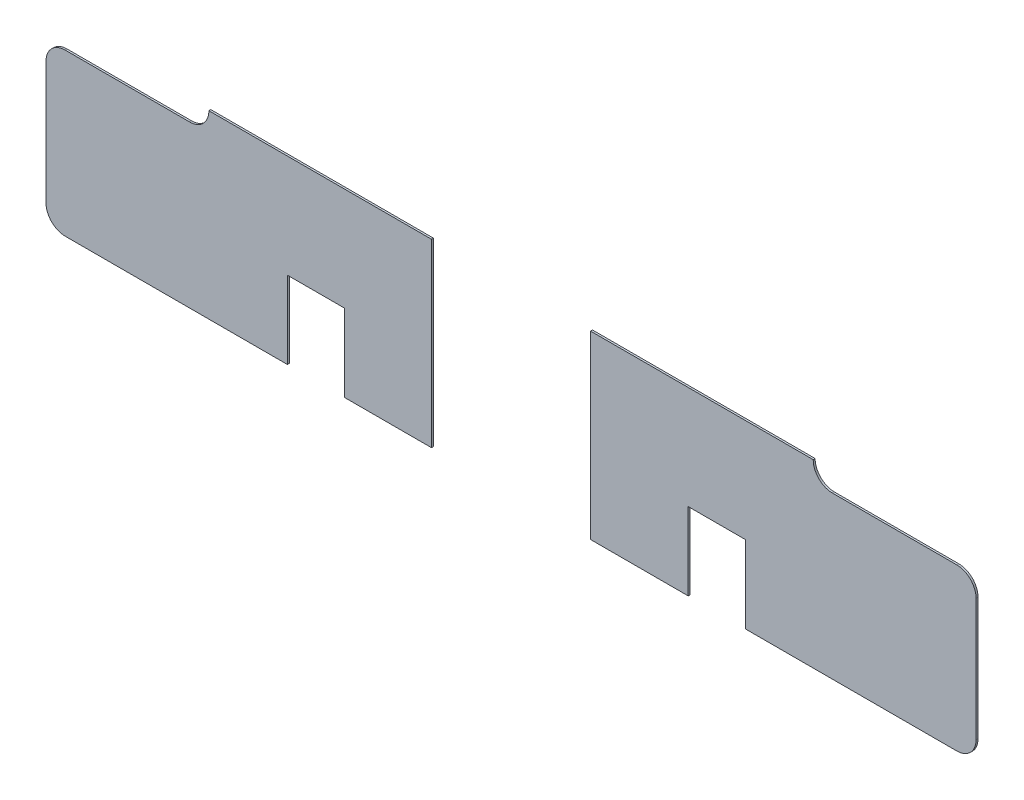
ISO-10303-21;
HEADER;
FILE_DESCRIPTION(('STEP AP214'),'2;1');
FILE_NAME('part.step','',(''),(''),'','','');
FILE_SCHEMA(('AUTOMOTIVE_DESIGN { 1 0 10303 214 1 1 1 1 }'));
ENDSEC;
DATA;
#1=APPLICATION_CONTEXT('core data for automotive mechanical design processes');
#2=APPLICATION_PROTOCOL_DEFINITION('international standard','automotive_design',2000,#1);
#3=PRODUCT_CONTEXT('',#1,'mechanical');
#4=PRODUCT('Part','Part','',(#3));
#5=PRODUCT_RELATED_PRODUCT_CATEGORY('part','',(#4));
#6=PRODUCT_DEFINITION_FORMATION('','',#4);
#7=PRODUCT_DEFINITION_CONTEXT('part definition',#1,'design');
#8=PRODUCT_DEFINITION('design','',#6,#7);
#9=PRODUCT_DEFINITION_SHAPE('','',#8);
#10=(LENGTH_UNIT() NAMED_UNIT(*) SI_UNIT(.MILLI.,.METRE.));
#11=(NAMED_UNIT(*) PLANE_ANGLE_UNIT() SI_UNIT($,.RADIAN.));
#12=(NAMED_UNIT(*) SI_UNIT($,.STERADIAN.) SOLID_ANGLE_UNIT());
#13=UNCERTAINTY_MEASURE_WITH_UNIT(LENGTH_MEASURE(1.E-05),#10,'distance_accuracy_value','');
#14=(GEOMETRIC_REPRESENTATION_CONTEXT(3) GLOBAL_UNCERTAINTY_ASSIGNED_CONTEXT((#13)) GLOBAL_UNIT_ASSIGNED_CONTEXT((#10,
#11,#12)) REPRESENTATION_CONTEXT('',''));
#15=CARTESIAN_POINT('',(0.,0.,0.));
#16=DIRECTION('',(0.,0.,1.));
#17=DIRECTION('',(1.,0.,0.));
#18=AXIS2_PLACEMENT_3D('',#15,#16,#17);
#19=CARTESIAN_POINT('',(0.,-2.80000000000001,0.1));
#20=DIRECTION('',(0.,-1.,0.));
#21=DIRECTION('',(1.,0.,0.));
#22=AXIS2_PLACEMENT_3D('',#19,#20,#21);
#23=PLANE('',#22);
#24=DIRECTION('',(-1.,0.,0.));
#25=VECTOR('',#24,1.);
#26=CARTESIAN_POINT('',(0.,-2.80000000000001,0.));
#27=LINE('',#26,#25);
#28=CARTESIAN_POINT('',(57.3430582988946,-2.80000000000003,0.));
#29=VERTEX_POINT('',#28);
#30=CARTESIAN_POINT('',(46.4068453882986,-2.80000000000003,0.));
#31=VERTEX_POINT('',#30);
#32=EDGE_CURVE('E160',#29,#31,#27,.T.);
#33=ORIENTED_EDGE('',*,*,#32,.F.);
#34=DIRECTION('',(0.,0.,-1.));
#35=VECTOR('',#34,1.);
#36=CARTESIAN_POINT('',(57.3430582988946,-2.80000000000003,0.1));
#37=LINE('',#36,#35);
#38=CARTESIAN_POINT('',(57.3430582988946,-2.80000000000003,0.1));
#39=VERTEX_POINT('',#38);
#40=EDGE_CURVE('E12',#39,#29,#37,.T.);
#41=ORIENTED_EDGE('',*,*,#40,.F.);
#42=DIRECTION('',(-1.,0.,0.));
#43=VECTOR('',#42,1.);
#44=CARTESIAN_POINT('',(0.,-2.80000000000001,0.1));
#45=LINE('',#44,#43);
#46=CARTESIAN_POINT('',(46.4068453882986,-2.80000000000003,0.1));
#47=VERTEX_POINT('',#46);
#48=EDGE_CURVE('E190',#39,#47,#45,.T.);
#49=ORIENTED_EDGE('',*,*,#48,.T.);
#50=DIRECTION('',(0.,0.,-1.));
#51=VECTOR('',#50,1.);
#52=CARTESIAN_POINT('',(46.4068453882986,-2.80000000000003,0.1));
#53=LINE('',#52,#51);
#54=EDGE_CURVE('E58',#47,#31,#53,.T.);
#55=ORIENTED_EDGE('',*,*,#54,.T.);
#56=EDGE_LOOP('',(#33,#41,#49,#55));
#57=FACE_BOUND('',#56,.T.);
#58=ADVANCED_FACE('F42',(#57),#23,.T.);
#59=CARTESIAN_POINT('',(57.3363916322279,-1.8066666666667,0.1));
#60=DIRECTION('',(0.,0.,-1.));
#61=DIRECTION('',(-1.,0.,0.));
#62=AXIS2_PLACEMENT_3D('',#59,#60,#61);
#63=CYLINDRICAL_SURFACE('',#62,0.993355704446072);
#64=CARTESIAN_POINT('',(57.3363916322279,-1.8066666666667,0.));
#65=DIRECTION('',(0.,0.,1.));
#66=DIRECTION('',(1.,0.,0.));
#67=AXIS2_PLACEMENT_3D('',#64,#65,#66);
#68=CIRCLE('',#67,0.993355704446072);
#69=CARTESIAN_POINT('',(58.3297249655613,-1.80000000000002,0.));
#70=VERTEX_POINT('',#69);
#71=EDGE_CURVE('E162',#29,#70,#68,.T.);
#72=ORIENTED_EDGE('',*,*,#71,.T.);
#73=DIRECTION('',(0.,0.,-1.));
#74=VECTOR('',#73,1.);
#75=CARTESIAN_POINT('',(58.3297249655613,-1.80000000000002,0.1));
#76=LINE('',#75,#74);
#77=CARTESIAN_POINT('',(58.3297249655613,-1.80000000000002,0.1));
#78=VERTEX_POINT('',#77);
#79=EDGE_CURVE('E50',#78,#70,#76,.T.);
#80=ORIENTED_EDGE('',*,*,#79,.F.);
#81=CARTESIAN_POINT('',(57.3363916322279,-1.8066666666667,0.1));
#82=DIRECTION('',(0.,0.,1.));
#83=DIRECTION('',(1.,0.,0.));
#84=AXIS2_PLACEMENT_3D('',#81,#82,#83);
#85=CIRCLE('',#84,0.993355704446072);
#86=EDGE_CURVE('E231',#39,#78,#85,.T.);
#87=ORIENTED_EDGE('',*,*,#86,.F.);
#88=ORIENTED_EDGE('',*,*,#40,.T.);
#89=EDGE_LOOP('',(#72,#80,#87,#88));
#90=FACE_BOUND('',#89,.T.);
#91=ADVANCED_FACE('F256',(#90),#63,.T.);
#92=CARTESIAN_POINT('',(58.3297249655613,-1.27820550443745E-13,0.1));
#93=DIRECTION('',(-1.,0.,0.));
#94=DIRECTION('',(0.,-1.,0.));
#95=AXIS2_PLACEMENT_3D('',#92,#93,#94);
#96=PLANE('',#95);
#97=DIRECTION('',(0.,1.,0.));
#98=VECTOR('',#97,1.);
#99=CARTESIAN_POINT('',(58.3297249655613,-1.27820550443745E-13,0.));
#100=LINE('',#99,#98);
#101=CARTESIAN_POINT('',(58.3297249655613,4.53299999999996,0.));
#102=VERTEX_POINT('',#101);
#103=EDGE_CURVE('E164',#70,#102,#100,.T.);
#104=ORIENTED_EDGE('',*,*,#103,.T.);
#105=DIRECTION('',(0.,0.,-1.));
#106=VECTOR('',#105,1.);
#107=CARTESIAN_POINT('',(58.3297249655613,4.53299999999996,0.1));
#108=LINE('',#107,#106);
#109=CARTESIAN_POINT('',(58.3297249655613,4.53299999999996,0.1));
#110=VERTEX_POINT('',#109);
#111=EDGE_CURVE('E204',#110,#102,#108,.T.);
#112=ORIENTED_EDGE('',*,*,#111,.F.);
#113=DIRECTION('',(0.,1.,0.));
#114=VECTOR('',#113,1.);
#115=CARTESIAN_POINT('',(58.3297249655613,-1.27820550443745E-13,0.1));
#116=LINE('',#115,#114);
#117=EDGE_CURVE('E213',#78,#110,#116,.T.);
#118=ORIENTED_EDGE('',*,*,#117,.F.);
#119=ORIENTED_EDGE('',*,*,#79,.T.);
#120=EDGE_LOOP('',(#104,#112,#118,#119));
#121=FACE_BOUND('',#120,.T.);
#122=ADVANCED_FACE('F211',(#121),#96,.F.);
#123=CARTESIAN_POINT('',(57.3363916322279,4.53966666666664,0.1));
#124=DIRECTION('',(0.,0.,-1.));
#125=DIRECTION('',(-1.,0.,0.));
#126=AXIS2_PLACEMENT_3D('',#123,#124,#125);
#127=CYLINDRICAL_SURFACE('',#126,0.993355704446079);
#128=CARTESIAN_POINT('',(57.3363916322279,4.53966666666664,0.));
#129=DIRECTION('',(0.,0.,1.));
#130=DIRECTION('',(1.,0.,0.));
#131=AXIS2_PLACEMENT_3D('',#128,#129,#130);
#132=CIRCLE('',#131,0.993355704446079);
#133=CARTESIAN_POINT('',(57.3430582988946,5.53299999999998,0.));
#134=VERTEX_POINT('',#133);
#135=EDGE_CURVE('E166',#102,#134,#132,.T.);
#136=ORIENTED_EDGE('',*,*,#135,.T.);
#137=DIRECTION('',(0.,0.,-1.));
#138=VECTOR('',#137,1.);
#139=CARTESIAN_POINT('',(57.3430582988946,5.53299999999998,0.1));
#140=LINE('',#139,#138);
#141=CARTESIAN_POINT('',(57.3430582988946,5.53299999999998,0.1));
#142=VERTEX_POINT('',#141);
#143=EDGE_CURVE('E202',#142,#134,#140,.T.);
#144=ORIENTED_EDGE('',*,*,#143,.F.);
#145=CARTESIAN_POINT('',(57.3363916322279,4.53966666666664,0.1));
#146=DIRECTION('',(0.,0.,1.));
#147=DIRECTION('',(1.,0.,0.));
#148=AXIS2_PLACEMENT_3D('',#145,#146,#147);
#149=CIRCLE('',#148,0.993355704446079);
#150=EDGE_CURVE('E225',#110,#142,#149,.T.);
#151=ORIENTED_EDGE('',*,*,#150,.F.);
#152=ORIENTED_EDGE('',*,*,#111,.T.);
#153=EDGE_LOOP('',(#136,#144,#151,#152));
#154=FACE_BOUND('',#153,.T.);
#155=ADVANCED_FACE('F222',(#154),#127,.T.);
#156=CARTESIAN_POINT('',(0.,5.53299999999996,0.1));
#157=DIRECTION('',(0.,1.,0.));
#158=DIRECTION('',(-1.,0.,0.));
#159=AXIS2_PLACEMENT_3D('',#156,#157,#158);
#160=PLANE('',#159);
#161=DIRECTION('',(1.,0.,0.));
#162=VECTOR('',#161,1.);
#163=CARTESIAN_POINT('',(0.,5.53299999999996,0.));
#164=LINE('',#163,#162);
#165=CARTESIAN_POINT('',(50.8971649655613,5.53299999999997,0.));
#166=VERTEX_POINT('',#165);
#167=EDGE_CURVE('E169',#166,#134,#164,.T.);
#168=ORIENTED_EDGE('',*,*,#167,.F.);
#169=DIRECTION('',(0.,0.,-1.));
#170=VECTOR('',#169,1.);
#171=CARTESIAN_POINT('',(50.8971649655613,5.53299999999997,0.1));
#172=LINE('',#171,#170);
#173=CARTESIAN_POINT('',(50.8971649655613,5.53299999999997,0.1));
#174=VERTEX_POINT('',#173);
#175=EDGE_CURVE('E200',#174,#166,#172,.T.);
#176=ORIENTED_EDGE('',*,*,#175,.F.);
#177=DIRECTION('',(1.,0.,0.));
#178=VECTOR('',#177,1.);
#179=CARTESIAN_POINT('',(0.,5.53299999999996,0.1));
#180=LINE('',#179,#178);
#181=EDGE_CURVE('E227',#174,#142,#180,.T.);
#182=ORIENTED_EDGE('',*,*,#181,.T.);
#183=ORIENTED_EDGE('',*,*,#143,.T.);
#184=EDGE_LOOP('',(#168,#176,#182,#183));
#185=FACE_BOUND('',#184,.T.);
#186=ADVANCED_FACE('F267',(#185),#160,.T.);
#187=CARTESIAN_POINT('',(50.9038316322279,6.52633333333336,0.1));
#188=DIRECTION('',(0.,0.,-1.));
#189=DIRECTION('',(-1.,0.,0.));
#190=AXIS2_PLACEMENT_3D('',#187,#188,#189);
#191=CYLINDRICAL_SURFACE('',#190,0.993355704446132);
#192=CARTESIAN_POINT('',(50.9038316322279,6.52633333333336,0.));
#193=DIRECTION('',(0.,0.,1.));
#194=DIRECTION('',(1.,0.,0.));
#195=AXIS2_PLACEMENT_3D('',#192,#193,#194);
#196=CIRCLE('',#195,0.993355704446132);
#197=CARTESIAN_POINT('',(49.9104982988945,6.53300000000002,0.));
#198=VERTEX_POINT('',#197);
#199=EDGE_CURVE('E172',#198,#166,#196,.T.);
#200=ORIENTED_EDGE('',*,*,#199,.F.);
#201=DIRECTION('',(0.,0.,-1.));
#202=VECTOR('',#201,1.);
#203=CARTESIAN_POINT('',(49.9104982988945,6.53300000000002,0.1));
#204=LINE('',#203,#202);
#205=CARTESIAN_POINT('',(49.9104982988945,6.53300000000002,0.1));
#206=VERTEX_POINT('',#205);
#207=EDGE_CURVE('E198',#206,#198,#204,.T.);
#208=ORIENTED_EDGE('',*,*,#207,.F.);
#209=CARTESIAN_POINT('',(50.9038316322279,6.52633333333336,0.1));
#210=DIRECTION('',(0.,0.,1.));
#211=DIRECTION('',(1.,0.,0.));
#212=AXIS2_PLACEMENT_3D('',#209,#210,#211);
#213=CIRCLE('',#212,0.993355704446132);
#214=EDGE_CURVE('E229',#206,#174,#213,.T.);
#215=ORIENTED_EDGE('',*,*,#214,.T.);
#216=ORIENTED_EDGE('',*,*,#175,.T.);
#217=EDGE_LOOP('',(#200,#208,#215,#216));
#218=FACE_BOUND('',#217,.T.);
#219=ADVANCED_FACE('F270',(#218),#191,.F.);
#220=CARTESIAN_POINT('',(0.,6.53300000000002,0.1));
#221=DIRECTION('',(0.,-1.,0.));
#222=DIRECTION('',(0.,0.,-1.));
#223=AXIS2_PLACEMENT_3D('',#220,#221,#222);
#224=PLANE('',#223);
#225=DIRECTION('',(-1.,0.,0.));
#226=VECTOR('',#225,1.);
#227=CARTESIAN_POINT('',(0.,6.53300000000002,0.));
#228=LINE('',#227,#226);
#229=CARTESIAN_POINT('',(38.4000449655613,6.53300000000002,0.));
#230=VERTEX_POINT('',#229);
#231=EDGE_CURVE('E175',#198,#230,#228,.T.);
#232=ORIENTED_EDGE('',*,*,#231,.T.);
#233=DIRECTION('',(0.,0.,-1.));
#234=VECTOR('',#233,1.);
#235=CARTESIAN_POINT('',(38.4000449655613,6.53300000000002,0.1));
#236=LINE('',#235,#234);
#237=CARTESIAN_POINT('',(38.4000449655613,6.53300000000002,0.1));
#238=VERTEX_POINT('',#237);
#239=EDGE_CURVE('E196',#238,#230,#236,.T.);
#240=ORIENTED_EDGE('',*,*,#239,.F.);
#241=DIRECTION('',(-1.,0.,0.));
#242=VECTOR('',#241,1.);
#243=CARTESIAN_POINT('',(0.,6.53300000000002,0.1));
#244=LINE('',#243,#242);
#245=EDGE_CURVE('E237',#206,#238,#244,.T.);
#246=ORIENTED_EDGE('',*,*,#245,.F.);
#247=ORIENTED_EDGE('',*,*,#207,.T.);
#248=EDGE_LOOP('',(#232,#240,#246,#247));
#249=FACE_BOUND('',#248,.T.);
#250=ADVANCED_FACE('F274',(#249),#224,.F.);
#251=CARTESIAN_POINT('',(38.4000449655613,0.,0.1));
#252=DIRECTION('',(-1.,0.,0.));
#253=DIRECTION('',(0.,-1.,0.));
#254=AXIS2_PLACEMENT_3D('',#251,#252,#253);
#255=PLANE('',#254);
#256=DIRECTION('',(0.,1.,0.));
#257=VECTOR('',#256,1.);
#258=CARTESIAN_POINT('',(38.4000449655613,0.,0.));
#259=LINE('',#258,#257);
#260=CARTESIAN_POINT('',(38.4000449655613,-2.80000000000003,0.));
#261=VERTEX_POINT('',#260);
#262=EDGE_CURVE('E178',#261,#230,#259,.T.);
#263=ORIENTED_EDGE('',*,*,#262,.F.);
#264=DIRECTION('',(0.,0.,-1.));
#265=VECTOR('',#264,1.);
#266=CARTESIAN_POINT('',(38.4000449655613,-2.80000000000003,0.1));
#267=LINE('',#266,#265);
#268=CARTESIAN_POINT('',(38.4000449655613,-2.80000000000003,0.1));
#269=VERTEX_POINT('',#268);
#270=EDGE_CURVE('E194',#269,#261,#267,.T.);
#271=ORIENTED_EDGE('',*,*,#270,.F.);
#272=DIRECTION('',(0.,1.,0.));
#273=VECTOR('',#272,1.);
#274=CARTESIAN_POINT('',(38.4000449655613,0.,0.1));
#275=LINE('',#274,#273);
#276=EDGE_CURVE('E239',#269,#238,#275,.T.);
#277=ORIENTED_EDGE('',*,*,#276,.T.);
#278=ORIENTED_EDGE('',*,*,#239,.T.);
#279=EDGE_LOOP('',(#263,#271,#277,#278));
#280=FACE_BOUND('',#279,.T.);
#281=ADVANCED_FACE('F278',(#280),#255,.T.);
#282=CARTESIAN_POINT('',(0.,-2.80000000000003,0.1));
#283=DIRECTION('',(0.,-1.,0.));
#284=DIRECTION('',(0.,0.,-1.));
#285=AXIS2_PLACEMENT_3D('',#282,#283,#284);
#286=PLANE('',#285);
#287=DIRECTION('',(-1.,0.,0.));
#288=VECTOR('',#287,1.);
#289=CARTESIAN_POINT('',(0.,-2.80000000000003,0.));
#290=LINE('',#289,#288);
#291=CARTESIAN_POINT('',(43.4468453882985,-2.80000000000003,0.));
#292=VERTEX_POINT('',#291);
#293=EDGE_CURVE('E181',#292,#261,#290,.T.);
#294=ORIENTED_EDGE('',*,*,#293,.F.);
#295=DIRECTION('',(0.,0.,-1.));
#296=VECTOR('',#295,1.);
#297=CARTESIAN_POINT('',(43.4468453882985,-2.80000000000003,0.1));
#298=LINE('',#297,#296);
#299=CARTESIAN_POINT('',(43.4468453882985,-2.80000000000003,0.1));
#300=VERTEX_POINT('',#299);
#301=EDGE_CURVE('E141',#300,#292,#298,.T.);
#302=ORIENTED_EDGE('',*,*,#301,.F.);
#303=DIRECTION('',(-1.,0.,0.));
#304=VECTOR('',#303,1.);
#305=CARTESIAN_POINT('',(0.,-2.80000000000003,0.1));
#306=LINE('',#305,#304);
#307=EDGE_CURVE('E152',#300,#269,#306,.T.);
#308=ORIENTED_EDGE('',*,*,#307,.T.);
#309=ORIENTED_EDGE('',*,*,#270,.T.);
#310=EDGE_LOOP('',(#294,#302,#308,#309));
#311=FACE_BOUND('',#310,.T.);
#312=ADVANCED_FACE('F243',(#311),#286,.T.);
#313=CARTESIAN_POINT('',(43.4468453882985,0.,0.1));
#314=DIRECTION('',(1.,0.,0.));
#315=DIRECTION('',(0.,0.,-1.));
#316=AXIS2_PLACEMENT_3D('',#313,#314,#315);
#317=PLANE('',#316);
#318=DIRECTION('',(0.,-1.,0.));
#319=VECTOR('',#318,1.);
#320=CARTESIAN_POINT('',(43.4468453882985,0.,0.));
#321=LINE('',#320,#319);
#322=CARTESIAN_POINT('',(43.4468453882985,1.19999999999997,0.));
#323=VERTEX_POINT('',#322);
#324=EDGE_CURVE('E137',#323,#292,#321,.T.);
#325=ORIENTED_EDGE('',*,*,#324,.F.);
#326=DIRECTION('',(0.,0.,-1.));
#327=VECTOR('',#326,1.);
#328=CARTESIAN_POINT('',(43.4468453882985,1.19999999999997,0.1));
#329=LINE('',#328,#327);
#330=CARTESIAN_POINT('',(43.4468453882985,1.19999999999997,0.1));
#331=VERTEX_POINT('',#330);
#332=EDGE_CURVE('E132',#331,#323,#329,.T.);
#333=ORIENTED_EDGE('',*,*,#332,.F.);
#334=DIRECTION('',(0.,-1.,0.));
#335=VECTOR('',#334,1.);
#336=CARTESIAN_POINT('',(43.4468453882985,0.,0.1));
#337=LINE('',#336,#335);
#338=EDGE_CURVE('E135',#331,#300,#337,.T.);
#339=ORIENTED_EDGE('',*,*,#338,.T.);
#340=ORIENTED_EDGE('',*,*,#301,.T.);
#341=EDGE_LOOP('',(#325,#333,#339,#340));
#342=FACE_BOUND('',#341,.T.);
#343=ADVANCED_FACE('F134',(#342),#317,.T.);
#344=CARTESIAN_POINT('',(0.,1.19999999999997,0.1));
#345=DIRECTION('',(0.,-1.,0.));
#346=DIRECTION('',(0.,0.,-1.));
#347=AXIS2_PLACEMENT_3D('',#344,#345,#346);
#348=PLANE('',#347);
#349=DIRECTION('',(-1.,0.,0.));
#350=VECTOR('',#349,1.);
#351=CARTESIAN_POINT('',(0.,1.19999999999997,0.));
#352=LINE('',#351,#350);
#353=CARTESIAN_POINT('',(46.4068453882986,1.19999999999997,0.));
#354=VERTEX_POINT('',#353);
#355=EDGE_CURVE('E185',#354,#323,#352,.T.);
#356=ORIENTED_EDGE('',*,*,#355,.F.);
#357=DIRECTION('',(0.,0.,-1.));
#358=VECTOR('',#357,1.);
#359=CARTESIAN_POINT('',(46.4068453882986,1.19999999999997,0.1));
#360=LINE('',#359,#358);
#361=CARTESIAN_POINT('',(46.4068453882986,1.19999999999997,0.1));
#362=VERTEX_POINT('',#361);
#363=EDGE_CURVE('E95',#362,#354,#360,.T.);
#364=ORIENTED_EDGE('',*,*,#363,.F.);
#365=DIRECTION('',(-1.,0.,0.));
#366=VECTOR('',#365,1.);
#367=CARTESIAN_POINT('',(0.,1.19999999999997,0.1));
#368=LINE('',#367,#366);
#369=EDGE_CURVE('E149',#362,#331,#368,.T.);
#370=ORIENTED_EDGE('',*,*,#369,.T.);
#371=ORIENTED_EDGE('',*,*,#332,.T.);
#372=EDGE_LOOP('',(#356,#364,#370,#371));
#373=FACE_BOUND('',#372,.T.);
#374=ADVANCED_FACE('F154',(#373),#348,.T.);
#375=CARTESIAN_POINT('',(46.4068453882986,0.,0.1));
#376=DIRECTION('',(-1.,0.,0.));
#377=DIRECTION('',(0.,0.,1.));
#378=AXIS2_PLACEMENT_3D('',#375,#376,#377);
#379=PLANE('',#378);
#380=DIRECTION('',(0.,1.,0.));
#381=VECTOR('',#380,1.);
#382=CARTESIAN_POINT('',(46.4068453882986,0.,0.));
#383=LINE('',#382,#381);
#384=EDGE_CURVE('E187',#31,#354,#383,.T.);
#385=ORIENTED_EDGE('',*,*,#384,.F.);
#386=ORIENTED_EDGE('',*,*,#54,.F.);
#387=DIRECTION('',(0.,1.,0.));
#388=VECTOR('',#387,1.);
#389=CARTESIAN_POINT('',(46.4068453882986,0.,0.1));
#390=LINE('',#389,#388);
#391=EDGE_CURVE('E155',#47,#362,#390,.T.);
#392=ORIENTED_EDGE('',*,*,#391,.T.);
#393=ORIENTED_EDGE('',*,*,#363,.T.);
#394=EDGE_LOOP('',(#385,#386,#392,#393));
#395=FACE_BOUND('',#394,.T.);
#396=ADVANCED_FACE('F245',(#395),#379,.T.);
#397=CARTESIAN_POINT('',(0.,0.,0.1));
#398=DIRECTION('',(0.,0.,1.));
#399=DIRECTION('',(1.,0.,0.));
#400=AXIS2_PLACEMENT_3D('',#397,#398,#399);
#401=PLANE('',#400);
#402=ORIENTED_EDGE('',*,*,#48,.F.);
#403=ORIENTED_EDGE('',*,*,#86,.T.);
#404=ORIENTED_EDGE('',*,*,#117,.T.);
#405=ORIENTED_EDGE('',*,*,#150,.T.);
#406=ORIENTED_EDGE('',*,*,#181,.F.);
#407=ORIENTED_EDGE('',*,*,#214,.F.);
#408=ORIENTED_EDGE('',*,*,#245,.T.);
#409=ORIENTED_EDGE('',*,*,#276,.F.);
#410=ORIENTED_EDGE('',*,*,#307,.F.);
#411=ORIENTED_EDGE('',*,*,#338,.F.);
#412=ORIENTED_EDGE('',*,*,#369,.F.);
#413=ORIENTED_EDGE('',*,*,#391,.F.);
#414=EDGE_LOOP('',(#402,#403,#404,#405,#406,#407,#408,#409,#410,#411,#412,#413));
#415=FACE_BOUND('',#414,.T.);
#416=ADVANCED_FACE('F147',(#415),#401,.T.);
#417=CARTESIAN_POINT('',(0.,0.,0.));
#418=DIRECTION('',(0.,0.,1.));
#419=DIRECTION('',(1.,0.,0.));
#420=AXIS2_PLACEMENT_3D('',#417,#418,#419);
#421=PLANE('',#420);
#422=ORIENTED_EDGE('',*,*,#32,.T.);
#423=ORIENTED_EDGE('',*,*,#384,.T.);
#424=ORIENTED_EDGE('',*,*,#355,.T.);
#425=ORIENTED_EDGE('',*,*,#324,.T.);
#426=ORIENTED_EDGE('',*,*,#293,.T.);
#427=ORIENTED_EDGE('',*,*,#262,.T.);
#428=ORIENTED_EDGE('',*,*,#231,.F.);
#429=ORIENTED_EDGE('',*,*,#199,.T.);
#430=ORIENTED_EDGE('',*,*,#167,.T.);
#431=ORIENTED_EDGE('',*,*,#135,.F.);
#432=ORIENTED_EDGE('',*,*,#103,.F.);
#433=ORIENTED_EDGE('',*,*,#71,.F.);
#434=EDGE_LOOP('',(#422,#423,#424,#425,#426,#427,#428,#429,#430,#431,#432,#433));
#435=FACE_BOUND('',#434,.T.);
#436=ADVANCED_FACE('F218',(#435),#421,.F.);
#437=CLOSED_SHELL('',(#58,#91,#122,#155,#186,#219,#250,#281,#312,#343,#374,#396,#416,#436));
#438=MANIFOLD_SOLID_BREP('B2',#437);
#439=CARTESIAN_POINT('',(0.,5.53299999999998,0.1));
#440=DIRECTION('',(0.,1.,0.));
#441=DIRECTION('',(-1.,0.,0.));
#442=AXIS2_PLACEMENT_3D('',#439,#440,#441);
#443=PLANE('',#442);
#444=DIRECTION('',(1.,0.,0.));
#445=VECTOR('',#444,1.);
#446=CARTESIAN_POINT('',(0.,5.53299999999998,0.));
#447=LINE('',#446,#445);
#448=CARTESIAN_POINT('',(11.2351382988946,5.53299999999997,0.));
#449=VERTEX_POINT('',#448);
#450=CARTESIAN_POINT('',(17.6810316322279,5.53299999999997,0.));
#451=VERTEX_POINT('',#450);
#452=EDGE_CURVE('E491',#449,#451,#447,.T.);
#453=ORIENTED_EDGE('',*,*,#452,.F.);
#454=DIRECTION('',(0.,0.,-1.));
#455=VECTOR('',#454,1.);
#456=CARTESIAN_POINT('',(11.2351382988946,5.53299999999997,0.1));
#457=LINE('',#456,#455);
#458=CARTESIAN_POINT('',(11.2351382988946,5.53299999999997,0.1));
#459=VERTEX_POINT('',#458);
#460=EDGE_CURVE('E40',#459,#449,#457,.T.);
#461=ORIENTED_EDGE('',*,*,#460,.F.);
#462=DIRECTION('',(1.,0.,0.));
#463=VECTOR('',#462,1.);
#464=CARTESIAN_POINT('',(0.,5.53299999999998,0.1));
#465=LINE('',#464,#463);
#466=CARTESIAN_POINT('',(17.6810316322279,5.53299999999997,0.1));
#467=VERTEX_POINT('',#466);
#468=EDGE_CURVE('E523',#459,#467,#465,.T.);
#469=ORIENTED_EDGE('',*,*,#468,.T.);
#470=DIRECTION('',(0.,0.,-1.));
#471=VECTOR('',#470,1.);
#472=CARTESIAN_POINT('',(17.6810316322279,5.53299999999997,0.1));
#473=LINE('',#472,#471);
#474=EDGE_CURVE('E389',#467,#451,#473,.T.);
#475=ORIENTED_EDGE('',*,*,#474,.T.);
#476=EDGE_LOOP('',(#453,#461,#469,#475));
#477=FACE_BOUND('',#476,.T.);
#478=ADVANCED_FACE('F373',(#477),#443,.T.);
#479=CARTESIAN_POINT('',(11.2418049655613,4.53966666666663,0.1));
#480=DIRECTION('',(0.,0.,-1.));
#481=DIRECTION('',(-1.,0.,0.));
#482=AXIS2_PLACEMENT_3D('',#479,#480,#481);
#483=CYLINDRICAL_SURFACE('',#482,0.993355704446075);
#484=CARTESIAN_POINT('',(11.2418049655613,4.53966666666663,0.));
#485=DIRECTION('',(0.,0.,1.));
#486=DIRECTION('',(1.,0.,0.));
#487=AXIS2_PLACEMENT_3D('',#484,#485,#486);
#488=CIRCLE('',#487,0.993355704446075);
#489=CARTESIAN_POINT('',(10.2484716322279,4.53299999999996,0.));
#490=VERTEX_POINT('',#489);
#491=EDGE_CURVE('E493',#449,#490,#488,.T.);
#492=ORIENTED_EDGE('',*,*,#491,.T.);
#493=DIRECTION('',(0.,0.,-1.));
#494=VECTOR('',#493,1.);
#495=CARTESIAN_POINT('',(10.2484716322279,4.53299999999996,0.1));
#496=LINE('',#495,#494);
#497=CARTESIAN_POINT('',(10.2484716322279,4.53299999999996,0.1));
#498=VERTEX_POINT('',#497);
#499=EDGE_CURVE('E381',#498,#490,#496,.T.);
#500=ORIENTED_EDGE('',*,*,#499,.F.);
#501=CARTESIAN_POINT('',(11.2418049655613,4.53966666666663,0.1));
#502=DIRECTION('',(0.,0.,1.));
#503=DIRECTION('',(1.,0.,0.));
#504=AXIS2_PLACEMENT_3D('',#501,#502,#503);
#505=CIRCLE('',#504,0.993355704446075);
#506=EDGE_CURVE('E561',#459,#498,#505,.T.);
#507=ORIENTED_EDGE('',*,*,#506,.F.);
#508=ORIENTED_EDGE('',*,*,#460,.T.);
#509=EDGE_LOOP('',(#492,#500,#507,#508));
#510=FACE_BOUND('',#509,.T.);
#511=ADVANCED_FACE('F547',(#510),#483,.T.);
#512=CARTESIAN_POINT('',(10.2484716322279,0.,0.1));
#513=DIRECTION('',(-1.,0.,0.));
#514=DIRECTION('',(0.,-1.,0.));
#515=AXIS2_PLACEMENT_3D('',#512,#513,#514);
#516=PLANE('',#515);
#517=DIRECTION('',(0.,1.,0.));
#518=VECTOR('',#517,1.);
#519=CARTESIAN_POINT('',(10.2484716322279,0.,0.));
#520=LINE('',#519,#518);
#521=CARTESIAN_POINT('',(10.2484716322279,-1.81333333333329,0.));
#522=VERTEX_POINT('',#521);
#523=EDGE_CURVE('E496',#522,#490,#520,.T.);
#524=ORIENTED_EDGE('',*,*,#523,.F.);
#525=DIRECTION('',(0.,0.,-1.));
#526=VECTOR('',#525,1.);
#527=CARTESIAN_POINT('',(10.2484716322279,-1.81333333333329,0.1));
#528=LINE('',#527,#526);
#529=CARTESIAN_POINT('',(10.2484716322279,-1.81333333333329,0.1));
#530=VERTEX_POINT('',#529);
#531=EDGE_CURVE('E537',#530,#522,#528,.T.);
#532=ORIENTED_EDGE('',*,*,#531,.F.);
#533=DIRECTION('',(0.,1.,0.));
#534=VECTOR('',#533,1.);
#535=CARTESIAN_POINT('',(10.2484716322279,0.,0.1));
#536=LINE('',#535,#534);
#537=EDGE_CURVE('E544',#530,#498,#536,.T.);
#538=ORIENTED_EDGE('',*,*,#537,.T.);
#539=ORIENTED_EDGE('',*,*,#499,.T.);
#540=EDGE_LOOP('',(#524,#532,#538,#539));
#541=FACE_BOUND('',#540,.T.);
#542=ADVANCED_FACE('F542',(#541),#516,.T.);
#543=CARTESIAN_POINT('',(11.2418049655613,-1.80666666666669,0.1));
#544=DIRECTION('',(0.,0.,-1.));
#545=DIRECTION('',(-1.,0.,0.));
#546=AXIS2_PLACEMENT_3D('',#543,#544,#545);
#547=CYLINDRICAL_SURFACE('',#546,0.993355704446074);
#548=CARTESIAN_POINT('',(11.2418049655613,-1.80666666666669,0.));
#549=DIRECTION('',(0.,0.,1.));
#550=DIRECTION('',(1.,0.,0.));
#551=AXIS2_PLACEMENT_3D('',#548,#549,#550);
#552=CIRCLE('',#551,0.993355704446074);
#553=CARTESIAN_POINT('',(11.2351382988946,-2.80000000000003,0.));
#554=VERTEX_POINT('',#553);
#555=EDGE_CURVE('E499',#522,#554,#552,.T.);
#556=ORIENTED_EDGE('',*,*,#555,.T.);
#557=DIRECTION('',(0.,0.,-1.));
#558=VECTOR('',#557,1.);
#559=CARTESIAN_POINT('',(11.2351382988946,-2.80000000000003,0.1));
#560=LINE('',#559,#558);
#561=CARTESIAN_POINT('',(11.2351382988946,-2.80000000000003,0.1));
#562=VERTEX_POINT('',#561);
#563=EDGE_CURVE('E535',#562,#554,#560,.T.);
#564=ORIENTED_EDGE('',*,*,#563,.F.);
#565=CARTESIAN_POINT('',(11.2418049655613,-1.80666666666669,0.1));
#566=DIRECTION('',(0.,0.,1.));
#567=DIRECTION('',(1.,0.,0.));
#568=AXIS2_PLACEMENT_3D('',#565,#566,#567);
#569=CIRCLE('',#568,0.993355704446074);
#570=EDGE_CURVE('E557',#530,#562,#569,.T.);
#571=ORIENTED_EDGE('',*,*,#570,.F.);
#572=ORIENTED_EDGE('',*,*,#531,.T.);
#573=EDGE_LOOP('',(#556,#564,#571,#572));
#574=FACE_BOUND('',#573,.T.);
#575=ADVANCED_FACE('F554',(#574),#547,.T.);
#576=CARTESIAN_POINT('',(0.,-2.80000000000003,0.1));
#577=DIRECTION('',(0.,-1.,0.));
#578=DIRECTION('',(1.,0.,0.));
#579=AXIS2_PLACEMENT_3D('',#576,#577,#578);
#580=PLANE('',#579);
#581=DIRECTION('',(-1.,0.,0.));
#582=VECTOR('',#581,1.);
#583=CARTESIAN_POINT('',(0.,-2.80000000000003,0.));
#584=LINE('',#583,#582);
#585=CARTESIAN_POINT('',(22.7268453882986,-2.80000000000003,0.));
#586=VERTEX_POINT('',#585);
#587=EDGE_CURVE('E502',#586,#554,#584,.T.);
#588=ORIENTED_EDGE('',*,*,#587,.F.);
#589=DIRECTION('',(0.,0.,-1.));
#590=VECTOR('',#589,1.);
#591=CARTESIAN_POINT('',(22.7268453882986,-2.80000000000003,0.1));
#592=LINE('',#591,#590);
#593=CARTESIAN_POINT('',(22.7268453882986,-2.80000000000003,0.1));
#594=VERTEX_POINT('',#593);
#595=EDGE_CURVE('E533',#594,#586,#592,.T.);
#596=ORIENTED_EDGE('',*,*,#595,.F.);
#597=DIRECTION('',(-1.,0.,0.));
#598=VECTOR('',#597,1.);
#599=CARTESIAN_POINT('',(0.,-2.80000000000003,0.1));
#600=LINE('',#599,#598);
#601=EDGE_CURVE('E559',#594,#562,#600,.T.);
#602=ORIENTED_EDGE('',*,*,#601,.T.);
#603=ORIENTED_EDGE('',*,*,#563,.T.);
#604=EDGE_LOOP('',(#588,#596,#602,#603));
#605=FACE_BOUND('',#604,.T.);
#606=ADVANCED_FACE('F600',(#605),#580,.T.);
#607=CARTESIAN_POINT('',(22.7268453882986,0.,0.1));
#608=DIRECTION('',(1.,0.,0.));
#609=DIRECTION('',(0.,0.,-1.));
#610=AXIS2_PLACEMENT_3D('',#607,#608,#609);
#611=PLANE('',#610);
#612=DIRECTION('',(0.,-1.,0.));
#613=VECTOR('',#612,1.);
#614=CARTESIAN_POINT('',(22.7268453882986,0.,0.));
#615=LINE('',#614,#613);
#616=CARTESIAN_POINT('',(22.7268453882986,1.19999999999997,0.));
#617=VERTEX_POINT('',#616);
#618=EDGE_CURVE('E505',#617,#586,#615,.T.);
#619=ORIENTED_EDGE('',*,*,#618,.F.);
#620=DIRECTION('',(0.,0.,-1.));
#621=VECTOR('',#620,1.);
#622=CARTESIAN_POINT('',(22.7268453882986,1.19999999999997,0.1));
#623=LINE('',#622,#621);
#624=CARTESIAN_POINT('',(22.7268453882986,1.19999999999997,0.1));
#625=VERTEX_POINT('',#624);
#626=EDGE_CURVE('E531',#625,#617,#623,.T.);
#627=ORIENTED_EDGE('',*,*,#626,.F.);
#628=DIRECTION('',(0.,-1.,0.));
#629=VECTOR('',#628,1.);
#630=CARTESIAN_POINT('',(22.7268453882986,0.,0.1));
#631=LINE('',#630,#629);
#632=EDGE_CURVE('E567',#625,#594,#631,.T.);
#633=ORIENTED_EDGE('',*,*,#632,.T.);
#634=ORIENTED_EDGE('',*,*,#595,.T.);
#635=EDGE_LOOP('',(#619,#627,#633,#634));
#636=FACE_BOUND('',#635,.T.);
#637=ADVANCED_FACE('F603',(#636),#611,.T.);
#638=CARTESIAN_POINT('',(0.,1.19999999999997,0.1));
#639=DIRECTION('',(0.,-1.,0.));
#640=DIRECTION('',(0.,0.,-1.));
#641=AXIS2_PLACEMENT_3D('',#638,#639,#640);
#642=PLANE('',#641);
#643=DIRECTION('',(-1.,0.,0.));
#644=VECTOR('',#643,1.);
#645=CARTESIAN_POINT('',(0.,1.19999999999997,0.));
#646=LINE('',#645,#644);
#647=CARTESIAN_POINT('',(25.6868453882986,1.19999999999997,0.));
#648=VERTEX_POINT('',#647);
#649=EDGE_CURVE('E508',#648,#617,#646,.T.);
#650=ORIENTED_EDGE('',*,*,#649,.F.);
#651=DIRECTION('',(0.,0.,-1.));
#652=VECTOR('',#651,1.);
#653=CARTESIAN_POINT('',(25.6868453882986,1.19999999999997,0.1));
#654=LINE('',#653,#652);
#655=CARTESIAN_POINT('',(25.6868453882986,1.19999999999997,0.1));
#656=VERTEX_POINT('',#655);
#657=EDGE_CURVE('E529',#656,#648,#654,.T.);
#658=ORIENTED_EDGE('',*,*,#657,.F.);
#659=DIRECTION('',(-1.,0.,0.));
#660=VECTOR('',#659,1.);
#661=CARTESIAN_POINT('',(0.,1.19999999999997,0.1));
#662=LINE('',#661,#660);
#663=EDGE_CURVE('E570',#656,#625,#662,.T.);
#664=ORIENTED_EDGE('',*,*,#663,.T.);
#665=ORIENTED_EDGE('',*,*,#626,.T.);
#666=EDGE_LOOP('',(#650,#658,#664,#665));
#667=FACE_BOUND('',#666,.T.);
#668=ADVANCED_FACE('F607',(#667),#642,.T.);
#669=CARTESIAN_POINT('',(25.6868453882986,0.,0.1));
#670=DIRECTION('',(-1.,0.,0.));
#671=DIRECTION('',(0.,0.,1.));
#672=AXIS2_PLACEMENT_3D('',#669,#670,#671);
#673=PLANE('',#672);
#674=DIRECTION('',(0.,1.,0.));
#675=VECTOR('',#674,1.);
#676=CARTESIAN_POINT('',(25.6868453882986,0.,0.));
#677=LINE('',#676,#675);
#678=CARTESIAN_POINT('',(25.6868453882986,-2.80000000000002,0.));
#679=VERTEX_POINT('',#678);
#680=EDGE_CURVE('E511',#679,#648,#677,.T.);
#681=ORIENTED_EDGE('',*,*,#680,.F.);
#682=DIRECTION('',(0.,0.,-1.));
#683=VECTOR('',#682,1.);
#684=CARTESIAN_POINT('',(25.6868453882986,-2.80000000000002,0.1));
#685=LINE('',#684,#683);
#686=CARTESIAN_POINT('',(25.6868453882986,-2.80000000000002,0.1));
#687=VERTEX_POINT('',#686);
#688=EDGE_CURVE('E527',#687,#679,#685,.T.);
#689=ORIENTED_EDGE('',*,*,#688,.F.);
#690=DIRECTION('',(0.,1.,0.));
#691=VECTOR('',#690,1.);
#692=CARTESIAN_POINT('',(25.6868453882986,0.,0.1));
#693=LINE('',#692,#691);
#694=EDGE_CURVE('E573',#687,#656,#693,.T.);
#695=ORIENTED_EDGE('',*,*,#694,.T.);
#696=ORIENTED_EDGE('',*,*,#657,.T.);
#697=EDGE_LOOP('',(#681,#689,#695,#696));
#698=FACE_BOUND('',#697,.T.);
#699=ADVANCED_FACE('F611',(#698),#673,.T.);
#700=CARTESIAN_POINT('',(0.,-2.8,0.1));
#701=DIRECTION('',(0.,-1.,0.));
#702=DIRECTION('',(1.,0.,0.));
#703=AXIS2_PLACEMENT_3D('',#700,#701,#702);
#704=PLANE('',#703);
#705=DIRECTION('',(-1.,0.,0.));
#706=VECTOR('',#705,1.);
#707=CARTESIAN_POINT('',(0.,-2.8,0.));
#708=LINE('',#707,#706);
#709=CARTESIAN_POINT('',(30.1781516322279,-2.80000000000003,0.));
#710=VERTEX_POINT('',#709);
#711=EDGE_CURVE('E514',#710,#679,#708,.T.);
#712=ORIENTED_EDGE('',*,*,#711,.F.);
#713=DIRECTION('',(0.,0.,-1.));
#714=VECTOR('',#713,1.);
#715=CARTESIAN_POINT('',(30.1781516322279,-2.80000000000003,0.1));
#716=LINE('',#715,#714);
#717=CARTESIAN_POINT('',(30.1781516322279,-2.80000000000003,0.1));
#718=VERTEX_POINT('',#717);
#719=EDGE_CURVE('E472',#718,#710,#716,.T.);
#720=ORIENTED_EDGE('',*,*,#719,.F.);
#721=DIRECTION('',(-1.,0.,0.));
#722=VECTOR('',#721,1.);
#723=CARTESIAN_POINT('',(0.,-2.8,0.1));
#724=LINE('',#723,#722);
#725=EDGE_CURVE('E483',#718,#687,#724,.T.);
#726=ORIENTED_EDGE('',*,*,#725,.T.);
#727=ORIENTED_EDGE('',*,*,#688,.T.);
#728=EDGE_LOOP('',(#712,#720,#726,#727));
#729=FACE_BOUND('',#728,.T.);
#730=ADVANCED_FACE('F577',(#729),#704,.T.);
#731=CARTESIAN_POINT('',(30.1781516322279,0.,0.1));
#732=DIRECTION('',(1.,0.,0.));
#733=DIRECTION('',(0.,1.,0.));
#734=AXIS2_PLACEMENT_3D('',#731,#732,#733);
#735=PLANE('',#734);
#736=DIRECTION('',(0.,-1.,0.));
#737=VECTOR('',#736,1.);
#738=CARTESIAN_POINT('',(30.1781516322279,0.,0.));
#739=LINE('',#738,#737);
#740=CARTESIAN_POINT('',(30.1781516322279,6.53299999999998,0.));
#741=VERTEX_POINT('',#740);
#742=EDGE_CURVE('E468',#741,#710,#739,.T.);
#743=ORIENTED_EDGE('',*,*,#742,.F.);
#744=DIRECTION('',(0.,0.,-1.));
#745=VECTOR('',#744,1.);
#746=CARTESIAN_POINT('',(30.1781516322279,6.53299999999998,0.1));
#747=LINE('',#746,#745);
#748=CARTESIAN_POINT('',(30.1781516322279,6.53299999999998,0.1));
#749=VERTEX_POINT('',#748);
#750=EDGE_CURVE('E463',#749,#741,#747,.T.);
#751=ORIENTED_EDGE('',*,*,#750,.F.);
#752=DIRECTION('',(0.,-1.,0.));
#753=VECTOR('',#752,1.);
#754=CARTESIAN_POINT('',(30.1781516322279,0.,0.1));
#755=LINE('',#754,#753);
#756=EDGE_CURVE('E466',#749,#718,#755,.T.);
#757=ORIENTED_EDGE('',*,*,#756,.T.);
#758=ORIENTED_EDGE('',*,*,#719,.T.);
#759=EDGE_LOOP('',(#743,#751,#757,#758));
#760=FACE_BOUND('',#759,.T.);
#761=ADVANCED_FACE('F465',(#760),#735,.T.);
#762=CARTESIAN_POINT('',(0.,6.53299999999998,0.1));
#763=DIRECTION('',(0.,1.,0.));
#764=DIRECTION('',(-1.,0.,0.));
#765=AXIS2_PLACEMENT_3D('',#762,#763,#764);
#766=PLANE('',#765);
#767=DIRECTION('',(1.,0.,0.));
#768=VECTOR('',#767,1.);
#769=CARTESIAN_POINT('',(0.,6.53299999999998,0.));
#770=LINE('',#769,#768);
#771=CARTESIAN_POINT('',(18.6676982988946,6.53299999999998,0.));
#772=VERTEX_POINT('',#771);
#773=EDGE_CURVE('E518',#772,#741,#770,.T.);
#774=ORIENTED_EDGE('',*,*,#773,.F.);
#775=DIRECTION('',(0.,0.,-1.));
#776=VECTOR('',#775,1.);
#777=CARTESIAN_POINT('',(18.6676982988946,6.53299999999998,0.1));
#778=LINE('',#777,#776);
#779=CARTESIAN_POINT('',(18.6676982988946,6.53299999999998,0.1));
#780=VERTEX_POINT('',#779);
#781=EDGE_CURVE('E426',#780,#772,#778,.T.);
#782=ORIENTED_EDGE('',*,*,#781,.F.);
#783=DIRECTION('',(1.,0.,0.));
#784=VECTOR('',#783,1.);
#785=CARTESIAN_POINT('',(0.,6.53299999999998,0.1));
#786=LINE('',#785,#784);
#787=EDGE_CURVE('E480',#780,#749,#786,.T.);
#788=ORIENTED_EDGE('',*,*,#787,.T.);
#789=ORIENTED_EDGE('',*,*,#750,.T.);
#790=EDGE_LOOP('',(#774,#782,#788,#789));
#791=FACE_BOUND('',#790,.T.);
#792=ADVANCED_FACE('F485',(#791),#766,.T.);
#793=CARTESIAN_POINT('',(17.6743649655613,6.52633333333328,0.1));
#794=DIRECTION('',(0.,0.,-1.));
#795=DIRECTION('',(-1.,0.,0.));
#796=AXIS2_PLACEMENT_3D('',#793,#794,#795);
#797=CYLINDRICAL_SURFACE('',#796,0.993355704446059);
#798=CARTESIAN_POINT('',(17.6743649655613,6.52633333333328,0.));
#799=DIRECTION('',(0.,0.,1.));
#800=DIRECTION('',(1.,0.,0.));
#801=AXIS2_PLACEMENT_3D('',#798,#799,#800);
#802=CIRCLE('',#801,0.993355704446059);
#803=EDGE_CURVE('E520',#451,#772,#802,.T.);
#804=ORIENTED_EDGE('',*,*,#803,.F.);
#805=ORIENTED_EDGE('',*,*,#474,.F.);
#806=CARTESIAN_POINT('',(17.6743649655613,6.52633333333328,0.1));
#807=DIRECTION('',(0.,0.,1.));
#808=DIRECTION('',(1.,0.,0.));
#809=AXIS2_PLACEMENT_3D('',#806,#807,#808);
#810=CIRCLE('',#809,0.993355704446059);
#811=EDGE_CURVE('E486',#467,#780,#810,.T.);
#812=ORIENTED_EDGE('',*,*,#811,.T.);
#813=ORIENTED_EDGE('',*,*,#781,.T.);
#814=EDGE_LOOP('',(#804,#805,#812,#813));
#815=FACE_BOUND('',#814,.T.);
#816=ADVANCED_FACE('F579',(#815),#797,.F.);
#817=CARTESIAN_POINT('',(0.,0.,0.1));
#818=DIRECTION('',(0.,0.,1.));
#819=DIRECTION('',(1.,0.,0.));
#820=AXIS2_PLACEMENT_3D('',#817,#818,#819);
#821=PLANE('',#820);
#822=ORIENTED_EDGE('',*,*,#468,.F.);
#823=ORIENTED_EDGE('',*,*,#506,.T.);
#824=ORIENTED_EDGE('',*,*,#537,.F.);
#825=ORIENTED_EDGE('',*,*,#570,.T.);
#826=ORIENTED_EDGE('',*,*,#601,.F.);
#827=ORIENTED_EDGE('',*,*,#632,.F.);
#828=ORIENTED_EDGE('',*,*,#663,.F.);
#829=ORIENTED_EDGE('',*,*,#694,.F.);
#830=ORIENTED_EDGE('',*,*,#725,.F.);
#831=ORIENTED_EDGE('',*,*,#756,.F.);
#832=ORIENTED_EDGE('',*,*,#787,.F.);
#833=ORIENTED_EDGE('',*,*,#811,.F.);
#834=EDGE_LOOP('',(#822,#823,#824,#825,#826,#827,#828,#829,#830,#831,#832,#833));
#835=FACE_BOUND('',#834,.T.);
#836=ADVANCED_FACE('F478',(#835),#821,.T.);
#837=CARTESIAN_POINT('',(0.,0.,0.));
#838=DIRECTION('',(0.,0.,1.));
#839=DIRECTION('',(1.,0.,0.));
#840=AXIS2_PLACEMENT_3D('',#837,#838,#839);
#841=PLANE('',#840);
#842=ORIENTED_EDGE('',*,*,#452,.T.);
#843=ORIENTED_EDGE('',*,*,#803,.T.);
#844=ORIENTED_EDGE('',*,*,#773,.T.);
#845=ORIENTED_EDGE('',*,*,#742,.T.);
#846=ORIENTED_EDGE('',*,*,#711,.T.);
#847=ORIENTED_EDGE('',*,*,#680,.T.);
#848=ORIENTED_EDGE('',*,*,#649,.T.);
#849=ORIENTED_EDGE('',*,*,#618,.T.);
#850=ORIENTED_EDGE('',*,*,#587,.T.);
#851=ORIENTED_EDGE('',*,*,#555,.F.);
#852=ORIENTED_EDGE('',*,*,#523,.T.);
#853=ORIENTED_EDGE('',*,*,#491,.F.);
#854=EDGE_LOOP('',(#842,#843,#844,#845,#846,#847,#848,#849,#850,#851,#852,#853));
#855=FACE_BOUND('',#854,.T.);
#856=ADVANCED_FACE('F550',(#855),#841,.F.);
#857=CLOSED_SHELL('',(#478,#511,#542,#575,#606,#637,#668,#699,#730,#761,#792,#816,#836,#856));
#858=MANIFOLD_SOLID_BREP('B6',#857);
#859=ADVANCED_BREP_SHAPE_REPRESENTATION('',(#18,#438,#858),#14);
#860=SHAPE_DEFINITION_REPRESENTATION(#9,#859);
ENDSEC;
END-ISO-10303-21;
